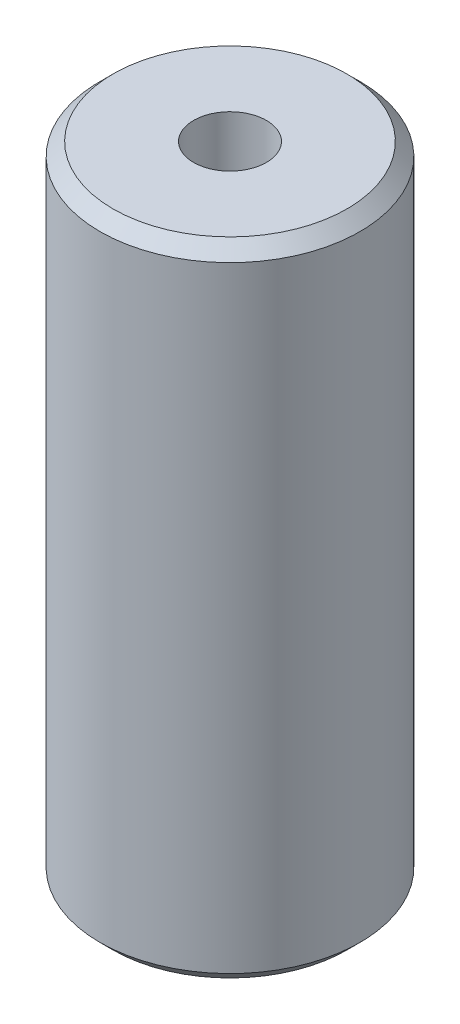
ISO-10303-21;
HEADER;
FILE_DESCRIPTION(('STEP AP214'),'2;1');
FILE_NAME('part.step','',(''),(''),'','','');
FILE_SCHEMA(('AUTOMOTIVE_DESIGN { 1 0 10303 214 1 1 1 1 }'));
ENDSEC;
DATA;
#1=APPLICATION_CONTEXT('core data for automotive mechanical design processes');
#2=APPLICATION_PROTOCOL_DEFINITION('international standard','automotive_design',2000,#1);
#3=PRODUCT_CONTEXT('',#1,'mechanical');
#4=PRODUCT('Part','Part','',(#3));
#5=PRODUCT_RELATED_PRODUCT_CATEGORY('part','',(#4));
#6=PRODUCT_DEFINITION_FORMATION('','',#4);
#7=PRODUCT_DEFINITION_CONTEXT('part definition',#1,'design');
#8=PRODUCT_DEFINITION('design','',#6,#7);
#9=PRODUCT_DEFINITION_SHAPE('','',#8);
#10=(LENGTH_UNIT() NAMED_UNIT(*) SI_UNIT(.MILLI.,.METRE.));
#11=(NAMED_UNIT(*) PLANE_ANGLE_UNIT() SI_UNIT($,.RADIAN.));
#12=(NAMED_UNIT(*) SI_UNIT($,.STERADIAN.) SOLID_ANGLE_UNIT());
#13=UNCERTAINTY_MEASURE_WITH_UNIT(LENGTH_MEASURE(1.E-05),#10,'distance_accuracy_value','');
#14=(GEOMETRIC_REPRESENTATION_CONTEXT(3) GLOBAL_UNCERTAINTY_ASSIGNED_CONTEXT((#13)) GLOBAL_UNIT_ASSIGNED_CONTEXT((#10,
#11,#12)) REPRESENTATION_CONTEXT('',''));
#15=CARTESIAN_POINT('',(0.,0.,0.));
#16=DIRECTION('',(0.,0.,1.));
#17=DIRECTION('',(1.,0.,0.));
#18=AXIS2_PLACEMENT_3D('',#15,#16,#17);
#19=CARTESIAN_POINT('',(0.,86.3804990309984,0.));
#20=DIRECTION('',(0.,-1.,0.));
#21=DIRECTION('',(0.,0.,-1.));
#22=AXIS2_PLACEMENT_3D('',#19,#20,#21);
#23=CYLINDRICAL_SURFACE('',#22,17.5);
#24=CARTESIAN_POINT('',(0.,84.6207401860642,0.));
#25=DIRECTION('',(0.,1.,0.));
#26=DIRECTION('',(0.,0.,1.));
#27=AXIS2_PLACEMENT_3D('',#24,#25,#26);
#28=CIRCLE('',#27,17.5);
#29=CARTESIAN_POINT('',(0.,84.6207401860642,17.5));
#30=VERTEX_POINT('',#29);
#31=EDGE_CURVE('E50',#30,#30,#28,.F.);
#32=ORIENTED_EDGE('',*,*,#31,.T.);
#33=EDGE_LOOP('',(#32));
#34=FACE_BOUND('',#33,.T.);
#35=CARTESIAN_POINT('',(0.,1.75975884493423,0.));
#36=DIRECTION('',(0.,1.,0.));
#37=DIRECTION('',(0.,0.,1.));
#38=AXIS2_PLACEMENT_3D('',#35,#36,#37);
#39=CIRCLE('',#38,17.5);
#40=CARTESIAN_POINT('',(0.,1.75975884493423,17.5));
#41=VERTEX_POINT('',#40);
#42=EDGE_CURVE('E51',#41,#41,#39,.T.);
#43=ORIENTED_EDGE('',*,*,#42,.T.);
#44=EDGE_LOOP('',(#43));
#45=FACE_BOUND('',#44,.T.);
#46=ADVANCED_FACE('F39',(#34,#45),#23,.T.);
#47=CARTESIAN_POINT('',(0.,86.3804990309984,0.));
#48=DIRECTION('',(0.,1.,0.));
#49=DIRECTION('',(0.,0.,1.));
#50=AXIS2_PLACEMENT_3D('',#47,#48,#49);
#51=PLANE('',#50);
#52=CARTESIAN_POINT('',(0.,86.3804990309984,0.));
#53=DIRECTION('',(0.,1.,0.));
#54=DIRECTION('',(0.,0.,1.));
#55=AXIS2_PLACEMENT_3D('',#52,#53,#54);
#56=CIRCLE('',#55,15.7402411550658);
#57=CARTESIAN_POINT('',(0.,86.3804990309984,15.7402411550658));
#58=VERTEX_POINT('',#57);
#59=EDGE_CURVE('E54',#58,#58,#56,.T.);
#60=ORIENTED_EDGE('',*,*,#59,.T.);
#61=EDGE_LOOP('',(#60));
#62=FACE_BOUND('',#61,.T.);
#63=CARTESIAN_POINT('',(0.,86.3804990309984,0.));
#64=DIRECTION('',(0.,1.,0.));
#65=DIRECTION('',(0.,0.,1.));
#66=AXIS2_PLACEMENT_3D('',#63,#64,#65);
#67=CIRCLE('',#66,4.90269208948087);
#68=CARTESIAN_POINT('',(0.,86.3804990309984,4.90269208948087));
#69=VERTEX_POINT('',#68);
#70=EDGE_CURVE('E58',#69,#69,#67,.T.);
#71=ORIENTED_EDGE('',*,*,#70,.F.);
#72=EDGE_LOOP('',(#71));
#73=FACE_BOUND('',#72,.T.);
#74=ADVANCED_FACE('F69',(#62,#73),#51,.T.);
#75=CARTESIAN_POINT('',(0.,0.,0.));
#76=DIRECTION('',(0.,1.,0.));
#77=DIRECTION('',(0.,0.,1.));
#78=AXIS2_PLACEMENT_3D('',#75,#76,#77);
#79=PLANE('',#78);
#80=CARTESIAN_POINT('',(0.,0.,0.));
#81=DIRECTION('',(0.,1.,0.));
#82=DIRECTION('',(0.,0.,1.));
#83=AXIS2_PLACEMENT_3D('',#80,#81,#82);
#84=CIRCLE('',#83,15.7402411550658);
#85=CARTESIAN_POINT('',(0.,0.,15.7402411550658));
#86=VERTEX_POINT('',#85);
#87=EDGE_CURVE('E10',#86,#86,#84,.F.);
#88=ORIENTED_EDGE('',*,*,#87,.T.);
#89=EDGE_LOOP('',(#88));
#90=FACE_BOUND('',#89,.T.);
#91=CARTESIAN_POINT('',(0.,0.,0.));
#92=DIRECTION('',(0.,1.,0.));
#93=DIRECTION('',(0.,0.,1.));
#94=AXIS2_PLACEMENT_3D('',#91,#92,#93);
#95=CIRCLE('',#94,4.90269208948087);
#96=CARTESIAN_POINT('',(0.,0.,4.90269208948087));
#97=VERTEX_POINT('',#96);
#98=EDGE_CURVE('E63',#97,#97,#95,.T.);
#99=ORIENTED_EDGE('',*,*,#98,.T.);
#100=EDGE_LOOP('',(#99));
#101=FACE_BOUND('',#100,.T.);
#102=ADVANCED_FACE('F75',(#90,#101),#79,.F.);
#103=CARTESIAN_POINT('',(0.,86.3804990309984,0.));
#104=DIRECTION('',(0.,-1.,0.));
#105=DIRECTION('',(0.,0.,-1.));
#106=AXIS2_PLACEMENT_3D('',#103,#104,#105);
#107=CYLINDRICAL_SURFACE('',#106,4.90269208948087);
#108=ORIENTED_EDGE('',*,*,#70,.T.);
#109=EDGE_LOOP('',(#108));
#110=FACE_BOUND('',#109,.T.);
#111=ORIENTED_EDGE('',*,*,#98,.F.);
#112=EDGE_LOOP('',(#111));
#113=FACE_BOUND('',#112,.T.);
#114=ADVANCED_FACE('F70',(#110,#113),#107,.F.);
#115=CARTESIAN_POINT('',(0.,86.3804990309984,0.));
#116=DIRECTION('',(0.,-1.,0.));
#117=DIRECTION('',(0.,0.,-1.));
#118=AXIS2_PLACEMENT_3D('',#115,#116,#117);
#119=CONICAL_SURFACE('',#118,15.7402411550658,0.785398163397445);
#120=ORIENTED_EDGE('',*,*,#31,.F.);
#121=EDGE_LOOP('',(#120));
#122=FACE_BOUND('',#121,.T.);
#123=ORIENTED_EDGE('',*,*,#59,.F.);
#124=EDGE_LOOP('',(#123));
#125=FACE_BOUND('',#124,.T.);
#126=ADVANCED_FACE('F81',(#122,#125),#119,.T.);
#127=CARTESIAN_POINT('',(0.,1.75975884493423,0.));
#128=DIRECTION('',(0.,1.,0.));
#129=DIRECTION('',(0.,0.,1.));
#130=AXIS2_PLACEMENT_3D('',#127,#128,#129);
#131=CONICAL_SURFACE('',#130,17.5,0.785398163397451);
#132=ORIENTED_EDGE('',*,*,#87,.F.);
#133=EDGE_LOOP('',(#132));
#134=FACE_BOUND('',#133,.T.);
#135=ORIENTED_EDGE('',*,*,#42,.F.);
#136=EDGE_LOOP('',(#135));
#137=FACE_BOUND('',#136,.T.);
#138=ADVANCED_FACE('F45',(#134,#137),#131,.T.);
#139=CLOSED_SHELL('',(#46,#74,#102,#114,#126,#138));
#140=MANIFOLD_SOLID_BREP('B2',#139);
#141=ADVANCED_BREP_SHAPE_REPRESENTATION('',(#18,#140),#14);
#142=SHAPE_DEFINITION_REPRESENTATION(#9,#141);
ENDSEC;
END-ISO-10303-21;
